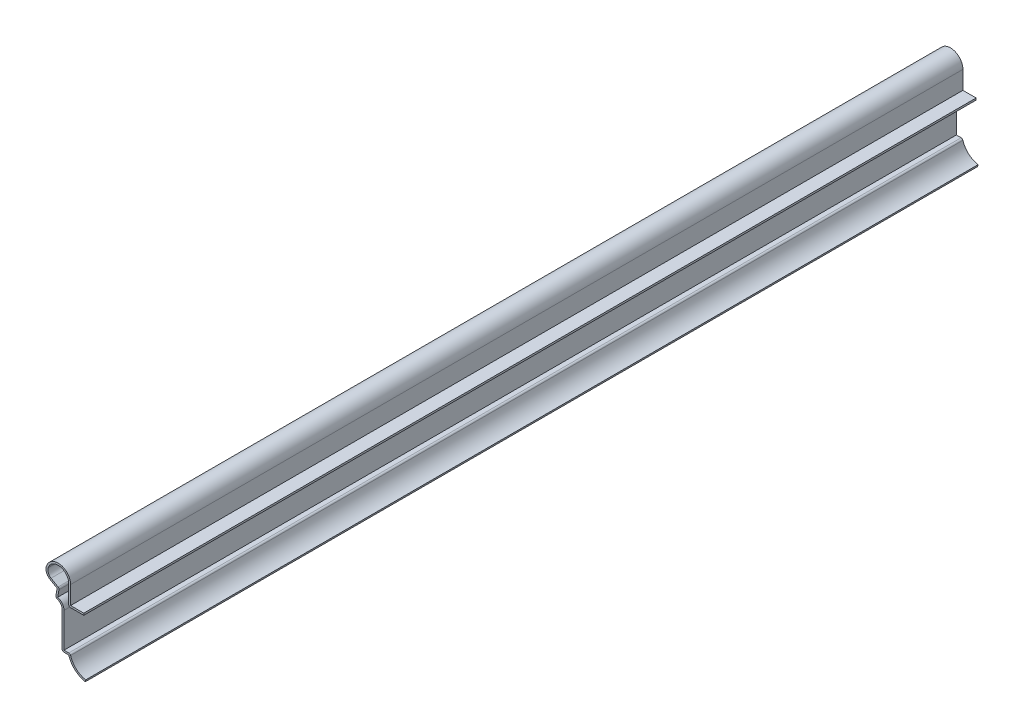
ISO-10303-21;
HEADER;
FILE_DESCRIPTION(('STEP AP214'),'2;1');
FILE_NAME('part.step','',(''),(''),'','','');
FILE_SCHEMA(('AUTOMOTIVE_DESIGN { 1 0 10303 214 1 1 1 1 }'));
ENDSEC;
DATA;
#1=APPLICATION_CONTEXT('core data for automotive mechanical design processes');
#2=APPLICATION_PROTOCOL_DEFINITION('international standard','automotive_design',2000,#1);
#3=PRODUCT_CONTEXT('',#1,'mechanical');
#4=PRODUCT('Part','Part','',(#3));
#5=PRODUCT_RELATED_PRODUCT_CATEGORY('part','',(#4));
#6=PRODUCT_DEFINITION_FORMATION('','',#4);
#7=PRODUCT_DEFINITION_CONTEXT('part definition',#1,'design');
#8=PRODUCT_DEFINITION('design','',#6,#7);
#9=PRODUCT_DEFINITION_SHAPE('','',#8);
#10=(LENGTH_UNIT() NAMED_UNIT(*) SI_UNIT(.MILLI.,.METRE.));
#11=(NAMED_UNIT(*) PLANE_ANGLE_UNIT() SI_UNIT($,.RADIAN.));
#12=(NAMED_UNIT(*) SI_UNIT($,.STERADIAN.) SOLID_ANGLE_UNIT());
#13=UNCERTAINTY_MEASURE_WITH_UNIT(LENGTH_MEASURE(1.E-05),#10,'distance_accuracy_value','');
#14=(GEOMETRIC_REPRESENTATION_CONTEXT(3) GLOBAL_UNCERTAINTY_ASSIGNED_CONTEXT((#13)) GLOBAL_UNIT_ASSIGNED_CONTEXT((#10,
#11,#12)) REPRESENTATION_CONTEXT('',''));
#15=CARTESIAN_POINT('',(0.,0.,0.));
#16=DIRECTION('',(0.,0.,1.));
#17=DIRECTION('',(1.,0.,0.));
#18=AXIS2_PLACEMENT_3D('',#15,#16,#17);
#19=CARTESIAN_POINT('',(-5.62173016512222,28.178125,-428.625));
#20=DIRECTION('',(0.,1.,0.));
#21=DIRECTION('',(0.,0.,1.));
#22=AXIS2_PLACEMENT_3D('',#19,#20,#21);
#23=PLANE('',#22);
#24=DIRECTION('',(1.,0.,0.));
#25=VECTOR('',#24,1.);
#26=CARTESIAN_POINT('',(-5.62173016512222,28.178125,0.));
#27=LINE('',#26,#25);
#28=CARTESIAN_POINT('',(-5.62173016512222,28.178125,0.));
#29=VERTEX_POINT('',#28);
#30=CARTESIAN_POINT('',(0.728269834877779,28.178125,0.));
#31=VERTEX_POINT('',#30);
#32=EDGE_CURVE('E234',#29,#31,#27,.T.);
#33=ORIENTED_EDGE('',*,*,#32,.T.);
#34=DIRECTION('',(0.,0.,1.));
#35=VECTOR('',#34,1.);
#36=CARTESIAN_POINT('',(0.728269834877779,28.178125,-428.625));
#37=LINE('',#36,#35);
#38=CARTESIAN_POINT('',(0.728269834877779,28.178125,-428.625));
#39=VERTEX_POINT('',#38);
#40=EDGE_CURVE('E216',#39,#31,#37,.T.);
#41=ORIENTED_EDGE('',*,*,#40,.F.);
#42=DIRECTION('',(1.,0.,0.));
#43=VECTOR('',#42,1.);
#44=CARTESIAN_POINT('',(-5.62173016512222,28.178125,-428.625));
#45=LINE('',#44,#43);
#46=CARTESIAN_POINT('',(-5.62173016512222,28.178125,-428.625));
#47=VERTEX_POINT('',#46);
#48=EDGE_CURVE('E222',#47,#39,#45,.T.);
#49=ORIENTED_EDGE('',*,*,#48,.F.);
#50=DIRECTION('',(0.,0.,1.));
#51=VECTOR('',#50,1.);
#52=CARTESIAN_POINT('',(-5.62173016512222,28.178125,-428.625));
#53=LINE('',#52,#51);
#54=EDGE_CURVE('E246',#47,#29,#53,.T.);
#55=ORIENTED_EDGE('',*,*,#54,.T.);
#56=EDGE_LOOP('',(#33,#41,#49,#55));
#57=FACE_BOUND('',#56,.T.);
#58=ADVANCED_FACE('F35',(#57),#23,.T.);
#59=CARTESIAN_POINT('',(-5.62173016512222,36.909375,-428.625));
#60=DIRECTION('',(1.,0.,0.));
#61=DIRECTION('',(0.,-1.,0.));
#62=AXIS2_PLACEMENT_3D('',#59,#60,#61);
#63=PLANE('',#62);
#64=DIRECTION('',(0.,-1.,0.));
#65=VECTOR('',#64,1.);
#66=CARTESIAN_POINT('',(-5.62173016512222,36.909375,0.));
#67=LINE('',#66,#65);
#68=CARTESIAN_POINT('',(-5.62173016512221,36.909375,0.));
#69=VERTEX_POINT('',#68);
#70=EDGE_CURVE('E231',#69,#29,#67,.T.);
#71=ORIENTED_EDGE('',*,*,#70,.T.);
#72=ORIENTED_EDGE('',*,*,#54,.F.);
#73=DIRECTION('',(0.,-1.,0.));
#74=VECTOR('',#73,1.);
#75=CARTESIAN_POINT('',(-5.62173016512222,36.909375,-428.625));
#76=LINE('',#75,#74);
#77=CARTESIAN_POINT('',(-5.62173016512221,36.909375,-428.625));
#78=VERTEX_POINT('',#77);
#79=EDGE_CURVE('E227',#78,#47,#76,.T.);
#80=ORIENTED_EDGE('',*,*,#79,.F.);
#81=DIRECTION('',(0.,0.,1.));
#82=VECTOR('',#81,1.);
#83=CARTESIAN_POINT('',(-5.62173016512221,36.909375,-428.625));
#84=LINE('',#83,#82);
#85=EDGE_CURVE('E347',#78,#69,#84,.T.);
#86=ORIENTED_EDGE('',*,*,#85,.T.);
#87=EDGE_LOOP('',(#71,#72,#80,#86));
#88=FACE_BOUND('',#87,.T.);
#89=ADVANCED_FACE('F453',(#88),#63,.T.);
#90=CARTESIAN_POINT('',(-11.5748551651222,36.909375,-428.625));
#91=DIRECTION('',(0.,0.,1.));
#92=DIRECTION('',(-1.,0.,0.));
#93=AXIS2_PLACEMENT_3D('',#90,#91,#92);
#94=CYLINDRICAL_SURFACE('',#93,5.953125);
#95=CARTESIAN_POINT('',(-11.5748551651222,36.909375,0.));
#96=DIRECTION('',(0.,0.,-1.));
#97=DIRECTION('',(-1.,0.,0.));
#98=AXIS2_PLACEMENT_3D('',#95,#96,#97);
#99=CIRCLE('',#98,5.953125);
#100=CARTESIAN_POINT('',(-17.2234836212635,38.7889211766331,0.));
#101=VERTEX_POINT('',#100);
#102=EDGE_CURVE('E343',#101,#69,#99,.T.);
#103=ORIENTED_EDGE('',*,*,#102,.T.);
#104=ORIENTED_EDGE('',*,*,#85,.F.);
#105=CARTESIAN_POINT('',(-11.5748551651222,36.909375,-428.625));
#106=DIRECTION('',(0.,0.,-1.));
#107=DIRECTION('',(-1.,0.,0.));
#108=AXIS2_PLACEMENT_3D('',#105,#106,#107);
#109=CIRCLE('',#108,5.953125);
#110=CARTESIAN_POINT('',(-17.2234836212635,38.7889211766331,-428.625));
#111=VERTEX_POINT('',#110);
#112=EDGE_CURVE('E238',#111,#78,#109,.T.);
#113=ORIENTED_EDGE('',*,*,#112,.F.);
#114=DIRECTION('',(0.,0.,1.));
#115=VECTOR('',#114,1.);
#116=CARTESIAN_POINT('',(-17.2234836212635,38.7889211766331,-428.625));
#117=LINE('',#116,#115);
#118=EDGE_CURVE('E350',#111,#101,#117,.T.);
#119=ORIENTED_EDGE('',*,*,#118,.T.);
#120=EDGE_LOOP('',(#103,#104,#113,#119));
#121=FACE_BOUND('',#120,.T.);
#122=ADVANCED_FACE('F449',(#121),#94,.T.);
#123=CARTESIAN_POINT('',(-13.4577313171693,37.535890392211,-428.625));
#124=DIRECTION('',(0.,0.,1.));
#125=DIRECTION('',(-1.,0.,0.));
#126=AXIS2_PLACEMENT_3D('',#123,#124,#125);
#127=CYLINDRICAL_SURFACE('',#126,3.96875);
#128=CARTESIAN_POINT('',(-13.4577313171693,37.535890392211,0.));
#129=DIRECTION('',(0.,0.,-1.));
#130=DIRECTION('',(-1.,0.,0.));
#131=AXIS2_PLACEMENT_3D('',#128,#129,#130);
#132=CIRCLE('',#131,3.96875);
#133=CARTESIAN_POINT('',(-15.4421063171693,34.0988520709416,0.));
#134=VERTEX_POINT('',#133);
#135=EDGE_CURVE('E341',#134,#101,#132,.T.);
#136=ORIENTED_EDGE('',*,*,#135,.T.);
#137=ORIENTED_EDGE('',*,*,#118,.F.);
#138=CARTESIAN_POINT('',(-13.4577313171693,37.535890392211,-428.625));
#139=DIRECTION('',(0.,0.,-1.));
#140=DIRECTION('',(-1.,0.,0.));
#141=AXIS2_PLACEMENT_3D('',#138,#139,#140);
#142=CIRCLE('',#141,3.96875);
#143=CARTESIAN_POINT('',(-15.4421063171693,34.0988520709416,-428.625));
#144=VERTEX_POINT('',#143);
#145=EDGE_CURVE('E442',#144,#111,#142,.T.);
#146=ORIENTED_EDGE('',*,*,#145,.F.);
#147=DIRECTION('',(0.,0.,1.));
#148=VECTOR('',#147,1.);
#149=CARTESIAN_POINT('',(-15.4421063171693,34.0988520709416,-428.625));
#150=LINE('',#149,#148);
#151=EDGE_CURVE('E353',#144,#134,#150,.T.);
#152=ORIENTED_EDGE('',*,*,#151,.T.);
#153=EDGE_LOOP('',(#136,#137,#146,#152));
#154=FACE_BOUND('',#153,.T.);
#155=ADVANCED_FACE('F458',(#154),#127,.T.);
#156=CARTESIAN_POINT('',(-12.061182855089,32.146875,-428.625));
#157=DIRECTION('',(-0.500000000000003,-0.866025403784437,0.));
#158=DIRECTION('',(-0.866025403784437,0.500000000000003,0.));
#159=AXIS2_PLACEMENT_3D('',#156,#157,#158);
#160=PLANE('',#159);
#161=DIRECTION('',(-0.866025403784437,0.500000000000003,0.));
#162=VECTOR('',#161,1.);
#163=CARTESIAN_POINT('',(-12.061182855089,32.146875,0.));
#164=LINE('',#163,#162);
#165=CARTESIAN_POINT('',(-12.061182855089,32.146875,0.));
#166=VERTEX_POINT('',#165);
#167=EDGE_CURVE('E339',#166,#134,#164,.T.);
#168=ORIENTED_EDGE('',*,*,#167,.T.);
#169=ORIENTED_EDGE('',*,*,#151,.F.);
#170=DIRECTION('',(-0.866025403784437,0.500000000000003,0.));
#171=VECTOR('',#170,1.);
#172=CARTESIAN_POINT('',(-12.061182855089,32.146875,-428.625));
#173=LINE('',#172,#171);
#174=CARTESIAN_POINT('',(-12.061182855089,32.146875,-428.625));
#175=VERTEX_POINT('',#174);
#176=EDGE_CURVE('E440',#175,#144,#173,.T.);
#177=ORIENTED_EDGE('',*,*,#176,.F.);
#178=DIRECTION('',(0.,0.,1.));
#179=VECTOR('',#178,1.);
#180=CARTESIAN_POINT('',(-12.061182855089,32.146875,-428.625));
#181=LINE('',#180,#179);
#182=EDGE_CURVE('E356',#175,#166,#181,.T.);
#183=ORIENTED_EDGE('',*,*,#182,.T.);
#184=EDGE_LOOP('',(#168,#169,#177,#183));
#185=FACE_BOUND('',#184,.T.);
#186=ADVANCED_FACE('F462',(#185),#160,.T.);
#187=CARTESIAN_POINT('',(-12.8309603302444,27.78125,-428.625));
#188=DIRECTION('',(-0.984807753012208,0.173648177666931,0.));
#189=DIRECTION('',(0.173648177666931,0.984807753012208,0.));
#190=AXIS2_PLACEMENT_3D('',#187,#188,#189);
#191=PLANE('',#190);
#192=DIRECTION('',(0.173648177666931,0.984807753012208,0.));
#193=VECTOR('',#192,1.);
#194=CARTESIAN_POINT('',(-12.8309603302444,27.78125,0.));
#195=LINE('',#194,#193);
#196=CARTESIAN_POINT('',(-12.6706512571569,28.6904079317213,0.));
#197=VERTEX_POINT('',#196);
#198=EDGE_CURVE('E337',#197,#166,#195,.T.);
#199=ORIENTED_EDGE('',*,*,#198,.T.);
#200=ORIENTED_EDGE('',*,*,#182,.F.);
#201=DIRECTION('',(0.173648177666931,0.984807753012208,0.));
#202=VECTOR('',#201,1.);
#203=CARTESIAN_POINT('',(-12.8309603302444,27.78125,-428.625));
#204=LINE('',#203,#202);
#205=CARTESIAN_POINT('',(-12.6706512571569,28.6904079317213,-428.625));
#206=VERTEX_POINT('',#205);
#207=EDGE_CURVE('E438',#206,#175,#204,.T.);
#208=ORIENTED_EDGE('',*,*,#207,.F.);
#209=DIRECTION('',(0.,0.,1.));
#210=VECTOR('',#209,1.);
#211=CARTESIAN_POINT('',(-12.6706512571569,28.6904079317213,-428.625));
#212=LINE('',#211,#210);
#213=EDGE_CURVE('E283',#197,#206,#212,.F.);
#214=ORIENTED_EDGE('',*,*,#213,.F.);
#215=EDGE_LOOP('',(#199,#200,#208,#214));
#216=FACE_BOUND('',#215,.T.);
#217=ADVANCED_FACE('F466',(#216),#191,.T.);
#218=CARTESIAN_POINT('',(-12.8309603302444,24.60625,-428.625));
#219=DIRECTION('',(0.,0.,1.));
#220=DIRECTION('',(-1.,0.,0.));
#221=AXIS2_PLACEMENT_3D('',#218,#219,#220);
#222=CYLINDRICAL_SURFACE('',#221,3.175);
#223=CARTESIAN_POINT('',(-12.8309603302444,24.60625,-428.625));
#224=DIRECTION('',(0.,0.,1.));
#225=DIRECTION('',(1.,0.,0.));
#226=AXIS2_PLACEMENT_3D('',#223,#224,#225);
#227=CIRCLE('',#226,3.175);
#228=CARTESIAN_POINT('',(-9.65596033024444,24.60625,-428.625));
#229=VERTEX_POINT('',#228);
#230=CARTESIAN_POINT('',(-12.0217391071855,27.6763942982621,-428.625));
#231=VERTEX_POINT('',#230);
#232=EDGE_CURVE('E435',#229,#231,#227,.T.);
#233=ORIENTED_EDGE('',*,*,#232,.F.);
#234=DIRECTION('',(0.,0.,1.));
#235=VECTOR('',#234,1.);
#236=CARTESIAN_POINT('',(-9.65596033024444,24.60625,-428.625));
#237=LINE('',#236,#235);
#238=CARTESIAN_POINT('',(-9.65596033024444,24.60625,0.));
#239=VERTEX_POINT('',#238);
#240=EDGE_CURVE('E359',#229,#239,#237,.T.);
#241=ORIENTED_EDGE('',*,*,#240,.T.);
#242=CARTESIAN_POINT('',(-12.8309603302444,24.60625,0.));
#243=DIRECTION('',(0.,0.,1.));
#244=DIRECTION('',(1.,0.,0.));
#245=AXIS2_PLACEMENT_3D('',#242,#243,#244);
#246=CIRCLE('',#245,3.175);
#247=CARTESIAN_POINT('',(-12.0217391071855,27.6763942982621,0.));
#248=VERTEX_POINT('',#247);
#249=EDGE_CURVE('E334',#239,#248,#246,.T.);
#250=ORIENTED_EDGE('',*,*,#249,.T.);
#251=DIRECTION('',(0.,0.,1.));
#252=VECTOR('',#251,1.);
#253=CARTESIAN_POINT('',(-12.0217391071855,27.6763942982621,-428.625));
#254=LINE('',#253,#252);
#255=EDGE_CURVE('E280',#231,#248,#254,.T.);
#256=ORIENTED_EDGE('',*,*,#255,.F.);
#257=EDGE_LOOP('',(#233,#241,#250,#256));
#258=FACE_BOUND('',#257,.T.);
#259=ADVANCED_FACE('F475',(#258),#222,.F.);
#260=CARTESIAN_POINT('',(-9.65596033024444,7.14375,-428.625));
#261=DIRECTION('',(-1.,0.,0.));
#262=DIRECTION('',(0.,1.,0.));
#263=AXIS2_PLACEMENT_3D('',#260,#261,#262);
#264=PLANE('',#263);
#265=DIRECTION('',(0.,1.,0.));
#266=VECTOR('',#265,1.);
#267=CARTESIAN_POINT('',(-9.65596033024444,7.14375,0.));
#268=LINE('',#267,#266);
#269=CARTESIAN_POINT('',(-9.65596033024444,8.03275,0.));
#270=VERTEX_POINT('',#269);
#271=EDGE_CURVE('E332',#270,#239,#268,.T.);
#272=ORIENTED_EDGE('',*,*,#271,.T.);
#273=ORIENTED_EDGE('',*,*,#240,.F.);
#274=DIRECTION('',(0.,1.,0.));
#275=VECTOR('',#274,1.);
#276=CARTESIAN_POINT('',(-9.65596033024444,7.14375,-428.625));
#277=LINE('',#276,#275);
#278=CARTESIAN_POINT('',(-9.65596033024444,8.03275,-428.625));
#279=VERTEX_POINT('',#278);
#280=EDGE_CURVE('E433',#279,#229,#277,.T.);
#281=ORIENTED_EDGE('',*,*,#280,.F.);
#282=DIRECTION('',(0.,0.,1.));
#283=VECTOR('',#282,1.);
#284=CARTESIAN_POINT('',(-9.65596033024444,8.03275,-428.625));
#285=LINE('',#284,#283);
#286=EDGE_CURVE('E271',#270,#279,#285,.F.);
#287=ORIENTED_EDGE('',*,*,#286,.F.);
#288=EDGE_LOOP('',(#272,#273,#281,#287));
#289=FACE_BOUND('',#288,.T.);
#290=ADVANCED_FACE('F479',(#289),#264,.T.);
#291=CARTESIAN_POINT('',(-6.48096033024444,7.14375,-428.625));
#292=DIRECTION('',(0.,-1.,0.));
#293=DIRECTION('',(0.,0.,-1.));
#294=AXIS2_PLACEMENT_3D('',#291,#292,#293);
#295=PLANE('',#294);
#296=DIRECTION('',(-1.,0.,0.));
#297=VECTOR('',#296,1.);
#298=CARTESIAN_POINT('',(-6.48096033024444,7.14375,-428.625));
#299=LINE('',#298,#297);
#300=CARTESIAN_POINT('',(-6.48096033024444,7.14375,-428.625));
#301=VERTEX_POINT('',#300);
#302=CARTESIAN_POINT('',(-8.76696033024444,7.14375,-428.625));
#303=VERTEX_POINT('',#302);
#304=EDGE_CURVE('E430',#301,#303,#299,.T.);
#305=ORIENTED_EDGE('',*,*,#304,.F.);
#306=DIRECTION('',(0.,0.,1.));
#307=VECTOR('',#306,1.);
#308=CARTESIAN_POINT('',(-6.48096033024444,7.14375,-428.625));
#309=LINE('',#308,#307);
#310=CARTESIAN_POINT('',(-6.48096033024444,7.14375,0.));
#311=VERTEX_POINT('',#310);
#312=EDGE_CURVE('E362',#301,#311,#309,.T.);
#313=ORIENTED_EDGE('',*,*,#312,.T.);
#314=DIRECTION('',(-1.,0.,0.));
#315=VECTOR('',#314,1.);
#316=CARTESIAN_POINT('',(-6.48096033024444,7.14375,0.));
#317=LINE('',#316,#315);
#318=CARTESIAN_POINT('',(-8.76696033024444,7.14375,0.));
#319=VERTEX_POINT('',#318);
#320=EDGE_CURVE('E329',#311,#319,#317,.T.);
#321=ORIENTED_EDGE('',*,*,#320,.T.);
#322=DIRECTION('',(0.,0.,1.));
#323=VECTOR('',#322,1.);
#324=CARTESIAN_POINT('',(-8.76696033024444,7.14375,-428.625));
#325=LINE('',#324,#323);
#326=EDGE_CURVE('E268',#303,#319,#325,.T.);
#327=ORIENTED_EDGE('',*,*,#326,.F.);
#328=EDGE_LOOP('',(#305,#313,#321,#327));
#329=FACE_BOUND('',#328,.T.);
#330=ADVANCED_FACE('F488',(#329),#295,.T.);
#331=CARTESIAN_POINT('',(3.3946889286634,10.1350963987865,-428.625));
#332=DIRECTION('',(0.,0.,1.));
#333=DIRECTION('',(-1.,0.,0.));
#334=AXIS2_PLACEMENT_3D('',#331,#332,#333);
#335=CYLINDRICAL_SURFACE('',#334,10.31875);
#336=CARTESIAN_POINT('',(3.3946889286634,10.1350963987865,0.));
#337=DIRECTION('',(0.,0.,-1.));
#338=DIRECTION('',(-1.,0.,0.));
#339=AXIS2_PLACEMENT_3D('',#336,#337,#338);
#340=CIRCLE('',#339,10.31875);
#341=CARTESIAN_POINT('',(1.45653966975556,0.,0.));
#342=VERTEX_POINT('',#341);
#343=EDGE_CURVE('E327',#342,#311,#340,.T.);
#344=ORIENTED_EDGE('',*,*,#343,.T.);
#345=ORIENTED_EDGE('',*,*,#312,.F.);
#346=CARTESIAN_POINT('',(3.3946889286634,10.1350963987865,-428.625));
#347=DIRECTION('',(0.,0.,-1.));
#348=DIRECTION('',(-1.,0.,0.));
#349=AXIS2_PLACEMENT_3D('',#346,#347,#348);
#350=CIRCLE('',#349,10.31875);
#351=CARTESIAN_POINT('',(1.45653966975556,0.,-428.625));
#352=VERTEX_POINT('',#351);
#353=EDGE_CURVE('E428',#352,#301,#350,.T.);
#354=ORIENTED_EDGE('',*,*,#353,.F.);
#355=DIRECTION('',(0.,0.,1.));
#356=VECTOR('',#355,1.);
#357=CARTESIAN_POINT('',(1.45653966975556,0.,-428.625));
#358=LINE('',#357,#356);
#359=EDGE_CURVE('E365',#352,#342,#358,.T.);
#360=ORIENTED_EDGE('',*,*,#359,.T.);
#361=EDGE_LOOP('',(#344,#345,#354,#360));
#362=FACE_BOUND('',#361,.T.);
#363=ADVANCED_FACE('F492',(#362),#335,.T.);
#364=CARTESIAN_POINT('',(1.45653966975556,0.,-428.625));
#365=DIRECTION('',(-0.982201952638304,0.187827911220627,0.));
#366=DIRECTION('',(0.187827911220627,0.982201952638303,0.));
#367=AXIS2_PLACEMENT_3D('',#364,#365,#366);
#368=PLANE('',#367);
#369=DIRECTION('',(0.187827911220627,0.982201952638303,0.));
#370=VECTOR('',#369,1.);
#371=CARTESIAN_POINT('',(1.45653966975556,0.,0.));
#372=LINE('',#371,#370);
#373=CARTESIAN_POINT('',(1.62351868283069,0.873177535895454,0.));
#374=VERTEX_POINT('',#373);
#375=EDGE_CURVE('E324',#342,#374,#372,.T.);
#376=ORIENTED_EDGE('',*,*,#375,.F.);
#377=ORIENTED_EDGE('',*,*,#359,.F.);
#378=DIRECTION('',(0.187827911220627,0.982201952638303,0.));
#379=VECTOR('',#378,1.);
#380=CARTESIAN_POINT('',(1.45653966975556,0.,-428.625));
#381=LINE('',#380,#379);
#382=CARTESIAN_POINT('',(1.62351868283069,0.873177535895454,-428.625));
#383=VERTEX_POINT('',#382);
#384=EDGE_CURVE('E425',#352,#383,#381,.T.);
#385=ORIENTED_EDGE('',*,*,#384,.T.);
#386=DIRECTION('',(0.,0.,1.));
#387=VECTOR('',#386,1.);
#388=CARTESIAN_POINT('',(1.62351868283069,0.873177535895454,-428.625));
#389=LINE('',#388,#387);
#390=EDGE_CURVE('E368',#383,#374,#389,.T.);
#391=ORIENTED_EDGE('',*,*,#390,.T.);
#392=EDGE_LOOP('',(#376,#377,#385,#391));
#393=FACE_BOUND('',#392,.T.);
#394=ADVANCED_FACE('F495',(#393),#368,.F.);
#395=CARTESIAN_POINT('',(3.3946889286634,10.1350963987865,-428.625));
#396=DIRECTION('',(0.,0.,1.));
#397=DIRECTION('',(-1.,0.,0.));
#398=AXIS2_PLACEMENT_3D('',#395,#396,#397);
#399=CYLINDRICAL_SURFACE('',#398,9.42975);
#400=CARTESIAN_POINT('',(3.3946889286634,10.1350963987865,0.));
#401=DIRECTION('',(0.,0.,-1.));
#402=DIRECTION('',(-1.,0.,0.));
#403=AXIS2_PLACEMENT_3D('',#400,#401,#402);
#404=CIRCLE('',#403,9.42975);
#405=CARTESIAN_POINT('',(-5.63013516332315,7.40146599743391,0.));
#406=VERTEX_POINT('',#405);
#407=EDGE_CURVE('E321',#374,#406,#404,.T.);
#408=ORIENTED_EDGE('',*,*,#407,.F.);
#409=ORIENTED_EDGE('',*,*,#390,.F.);
#410=CARTESIAN_POINT('',(3.3946889286634,10.1350963987865,-428.625));
#411=DIRECTION('',(0.,0.,-1.));
#412=DIRECTION('',(-1.,0.,0.));
#413=AXIS2_PLACEMENT_3D('',#410,#411,#412);
#414=CIRCLE('',#413,9.42975);
#415=CARTESIAN_POINT('',(-5.63013516332315,7.40146599743391,-428.625));
#416=VERTEX_POINT('',#415);
#417=EDGE_CURVE('E422',#383,#416,#414,.T.);
#418=ORIENTED_EDGE('',*,*,#417,.T.);
#419=DIRECTION('',(0.,0.,1.));
#420=VECTOR('',#419,1.);
#421=CARTESIAN_POINT('',(-5.63013516332315,7.40146599743391,-428.625));
#422=LINE('',#421,#420);
#423=EDGE_CURVE('E256',#406,#416,#422,.F.);
#424=ORIENTED_EDGE('',*,*,#423,.F.);
#425=EDGE_LOOP('',(#408,#409,#418,#424));
#426=FACE_BOUND('',#425,.T.);
#427=ADVANCED_FACE('F498',(#426),#399,.F.);
#428=CARTESIAN_POINT('',(-6.48096033024444,8.03275,-428.625));
#429=DIRECTION('',(0.,-1.,0.));
#430=DIRECTION('',(0.,0.,-1.));
#431=AXIS2_PLACEMENT_3D('',#428,#429,#430);
#432=PLANE('',#431);
#433=DIRECTION('',(-1.,0.,0.));
#434=VECTOR('',#433,1.);
#435=CARTESIAN_POINT('',(-6.48096033024444,8.03275,-428.625));
#436=LINE('',#435,#434);
#437=CARTESIAN_POINT('',(-6.48096033024444,8.03275,-428.625));
#438=VERTEX_POINT('',#437);
#439=CARTESIAN_POINT('',(-8.76696033024444,8.03275,-428.625));
#440=VERTEX_POINT('',#439);
#441=EDGE_CURVE('E419',#438,#440,#436,.T.);
#442=ORIENTED_EDGE('',*,*,#441,.T.);
#443=DIRECTION('',(0.,0.,1.));
#444=VECTOR('',#443,1.);
#445=CARTESIAN_POINT('',(-8.76696033024444,8.03275,-428.625));
#446=LINE('',#445,#444);
#447=CARTESIAN_POINT('',(-8.76696033024444,8.03275,0.));
#448=VERTEX_POINT('',#447);
#449=EDGE_CURVE('E371',#440,#448,#446,.T.);
#450=ORIENTED_EDGE('',*,*,#449,.T.);
#451=DIRECTION('',(-1.,0.,0.));
#452=VECTOR('',#451,1.);
#453=CARTESIAN_POINT('',(-6.48096033024444,8.03275,0.));
#454=LINE('',#453,#452);
#455=CARTESIAN_POINT('',(-6.48096033024444,8.03275,0.));
#456=VERTEX_POINT('',#455);
#457=EDGE_CURVE('E318',#456,#448,#454,.T.);
#458=ORIENTED_EDGE('',*,*,#457,.F.);
#459=DIRECTION('',(0.,0.,1.));
#460=VECTOR('',#459,1.);
#461=CARTESIAN_POINT('',(-6.48096033024444,8.03275,-428.625));
#462=LINE('',#461,#460);
#463=EDGE_CURVE('E242',#438,#456,#462,.T.);
#464=ORIENTED_EDGE('',*,*,#463,.F.);
#465=EDGE_LOOP('',(#442,#450,#458,#464));
#466=FACE_BOUND('',#465,.T.);
#467=ADVANCED_FACE('F506',(#466),#432,.F.);
#468=CARTESIAN_POINT('',(-8.76696033024444,7.14375,-428.625));
#469=DIRECTION('',(-1.,0.,0.));
#470=DIRECTION('',(0.,1.,0.));
#471=AXIS2_PLACEMENT_3D('',#468,#469,#470);
#472=PLANE('',#471);
#473=DIRECTION('',(0.,1.,0.));
#474=VECTOR('',#473,1.);
#475=CARTESIAN_POINT('',(-8.76696033024444,7.14375,0.));
#476=LINE('',#475,#474);
#477=CARTESIAN_POINT('',(-8.76696033024444,24.60625,0.));
#478=VERTEX_POINT('',#477);
#479=EDGE_CURVE('E315',#448,#478,#476,.T.);
#480=ORIENTED_EDGE('',*,*,#479,.F.);
#481=ORIENTED_EDGE('',*,*,#449,.F.);
#482=DIRECTION('',(0.,1.,0.));
#483=VECTOR('',#482,1.);
#484=CARTESIAN_POINT('',(-8.76696033024444,7.14375,-428.625));
#485=LINE('',#484,#483);
#486=CARTESIAN_POINT('',(-8.76696033024444,24.60625,-428.625));
#487=VERTEX_POINT('',#486);
#488=EDGE_CURVE('E416',#440,#487,#485,.T.);
#489=ORIENTED_EDGE('',*,*,#488,.T.);
#490=DIRECTION('',(0.,0.,1.));
#491=VECTOR('',#490,1.);
#492=CARTESIAN_POINT('',(-8.76696033024444,24.60625,-428.625));
#493=LINE('',#492,#491);
#494=EDGE_CURVE('E374',#487,#478,#493,.T.);
#495=ORIENTED_EDGE('',*,*,#494,.T.);
#496=EDGE_LOOP('',(#480,#481,#489,#495));
#497=FACE_BOUND('',#496,.T.);
#498=ADVANCED_FACE('F509',(#497),#472,.F.);
#499=CARTESIAN_POINT('',(-12.8309603302444,24.60625,-428.625));
#500=DIRECTION('',(0.,0.,1.));
#501=DIRECTION('',(-1.,0.,0.));
#502=AXIS2_PLACEMENT_3D('',#499,#500,#501);
#503=CYLINDRICAL_SURFACE('',#502,4.064);
#504=CARTESIAN_POINT('',(-12.8309603302444,24.60625,0.));
#505=DIRECTION('',(0.,0.,-1.));
#506=DIRECTION('',(-1.,0.,0.));
#507=AXIS2_PLACEMENT_3D('',#504,#505,#506);
#508=CIRCLE('',#507,4.064);
#509=CARTESIAN_POINT('',(-11.795157164729,28.5360347017754,0.));
#510=VERTEX_POINT('',#509);
#511=EDGE_CURVE('E312',#478,#510,#508,.F.);
#512=ORIENTED_EDGE('',*,*,#511,.F.);
#513=ORIENTED_EDGE('',*,*,#494,.F.);
#514=CARTESIAN_POINT('',(-12.8309603302444,24.60625,-428.625));
#515=DIRECTION('',(0.,0.,-1.));
#516=DIRECTION('',(-1.,0.,0.));
#517=AXIS2_PLACEMENT_3D('',#514,#515,#516);
#518=CIRCLE('',#517,4.064);
#519=CARTESIAN_POINT('',(-11.795157164729,28.5360347017754,-428.625));
#520=VERTEX_POINT('',#519);
#521=EDGE_CURVE('E413',#487,#520,#518,.F.);
#522=ORIENTED_EDGE('',*,*,#521,.T.);
#523=DIRECTION('',(0.,0.,1.));
#524=VECTOR('',#523,1.);
#525=CARTESIAN_POINT('',(-11.795157164729,28.5360347017754,-428.625));
#526=LINE('',#525,#524);
#527=EDGE_CURVE('E377',#520,#510,#526,.T.);
#528=ORIENTED_EDGE('',*,*,#527,.T.);
#529=EDGE_LOOP('',(#512,#513,#522,#528));
#530=FACE_BOUND('',#529,.T.);
#531=ADVANCED_FACE('F512',(#530),#503,.T.);
#532=CARTESIAN_POINT('',(-11.9554662378166,27.6268767700541,-428.625));
#533=DIRECTION('',(-0.984807753012208,0.173648177666931,0.));
#534=DIRECTION('',(0.173648177666931,0.984807753012208,0.));
#535=AXIS2_PLACEMENT_3D('',#532,#533,#534);
#536=PLANE('',#535);
#537=DIRECTION('',(0.173648177666931,0.984807753012208,0.));
#538=VECTOR('',#537,1.);
#539=CARTESIAN_POINT('',(-11.9554662378166,27.6268767700541,0.));
#540=LINE('',#539,#538);
#541=CARTESIAN_POINT('',(-11.1856887626612,31.9925017700541,0.));
#542=VERTEX_POINT('',#541);
#543=EDGE_CURVE('E309',#510,#542,#540,.T.);
#544=ORIENTED_EDGE('',*,*,#543,.F.);
#545=ORIENTED_EDGE('',*,*,#527,.F.);
#546=DIRECTION('',(0.173648177666931,0.984807753012208,0.));
#547=VECTOR('',#546,1.);
#548=CARTESIAN_POINT('',(-11.9554662378166,27.6268767700541,-428.625));
#549=LINE('',#548,#547);
#550=CARTESIAN_POINT('',(-11.1856887626612,31.9925017700541,-428.625));
#551=VERTEX_POINT('',#550);
#552=EDGE_CURVE('E405',#520,#551,#549,.T.);
#553=ORIENTED_EDGE('',*,*,#552,.T.);
#554=DIRECTION('',(0.,0.,1.));
#555=VECTOR('',#554,1.);
#556=CARTESIAN_POINT('',(-11.1856887626612,31.9925017700541,-428.625));
#557=LINE('',#556,#555);
#558=EDGE_CURVE('E277',#542,#551,#557,.F.);
#559=ORIENTED_EDGE('',*,*,#558,.F.);
#560=EDGE_LOOP('',(#544,#545,#553,#559));
#561=FACE_BOUND('',#560,.T.);
#562=ADVANCED_FACE('F516',(#561),#536,.F.);
#563=CARTESIAN_POINT('',(-11.616682855089,32.9167715839644,-428.625));
#564=DIRECTION('',(-0.500000000000003,-0.866025403784437,0.));
#565=DIRECTION('',(-0.866025403784437,0.500000000000003,0.));
#566=AXIS2_PLACEMENT_3D('',#563,#564,#565);
#567=PLANE('',#566);
#568=DIRECTION('',(-0.866025403784437,0.500000000000003,0.));
#569=VECTOR('',#568,1.);
#570=CARTESIAN_POINT('',(-11.616682855089,32.9167715839644,-428.625));
#571=LINE('',#570,#569);
#572=CARTESIAN_POINT('',(-11.616682855089,32.9167715839644,-428.625));
#573=VERTEX_POINT('',#572);
#574=CARTESIAN_POINT('',(-14.9976063171693,34.8687486549059,-428.625));
#575=VERTEX_POINT('',#574);
#576=EDGE_CURVE('E403',#573,#575,#571,.T.);
#577=ORIENTED_EDGE('',*,*,#576,.T.);
#578=DIRECTION('',(0.,0.,1.));
#579=VECTOR('',#578,1.);
#580=CARTESIAN_POINT('',(-14.9976063171693,34.8687486549059,-428.625));
#581=LINE('',#580,#579);
#582=CARTESIAN_POINT('',(-14.9976063171693,34.8687486549059,0.));
#583=VERTEX_POINT('',#582);
#584=EDGE_CURVE('E380',#575,#583,#581,.T.);
#585=ORIENTED_EDGE('',*,*,#584,.T.);
#586=DIRECTION('',(-0.866025403784437,0.500000000000003,0.));
#587=VECTOR('',#586,1.);
#588=CARTESIAN_POINT('',(-11.616682855089,32.9167715839644,0.));
#589=LINE('',#588,#587);
#590=CARTESIAN_POINT('',(-11.616682855089,32.9167715839644,0.));
#591=VERTEX_POINT('',#590);
#592=EDGE_CURVE('E306',#591,#583,#589,.T.);
#593=ORIENTED_EDGE('',*,*,#592,.F.);
#594=DIRECTION('',(0.,0.,1.));
#595=VECTOR('',#594,1.);
#596=CARTESIAN_POINT('',(-11.616682855089,32.9167715839644,-428.625));
#597=LINE('',#596,#595);
#598=EDGE_CURVE('E274',#573,#591,#597,.T.);
#599=ORIENTED_EDGE('',*,*,#598,.F.);
#600=EDGE_LOOP('',(#577,#585,#593,#599));
#601=FACE_BOUND('',#600,.T.);
#602=ADVANCED_FACE('F521',(#601),#567,.F.);
#603=CARTESIAN_POINT('',(-13.4577313171693,37.535890392211,-428.625));
#604=DIRECTION('',(0.,0.,1.));
#605=DIRECTION('',(-1.,0.,0.));
#606=AXIS2_PLACEMENT_3D('',#603,#604,#605);
#607=CYLINDRICAL_SURFACE('',#606,3.07975);
#608=CARTESIAN_POINT('',(-13.4577313171693,37.535890392211,0.));
#609=DIRECTION('',(0.,0.,-1.));
#610=DIRECTION('',(-1.,0.,0.));
#611=AXIS2_PLACEMENT_3D('',#608,#609,#610);
#612=CIRCLE('',#611,3.07975);
#613=CARTESIAN_POINT('',(-16.3799551051464,38.5082422809226,0.));
#614=VERTEX_POINT('',#613);
#615=EDGE_CURVE('E303',#583,#614,#612,.T.);
#616=ORIENTED_EDGE('',*,*,#615,.F.);
#617=ORIENTED_EDGE('',*,*,#584,.F.);
#618=CARTESIAN_POINT('',(-13.4577313171693,37.535890392211,-428.625));
#619=DIRECTION('',(0.,0.,-1.));
#620=DIRECTION('',(-1.,0.,0.));
#621=AXIS2_PLACEMENT_3D('',#618,#619,#620);
#622=CIRCLE('',#621,3.07975);
#623=CARTESIAN_POINT('',(-16.3799551051464,38.5082422809226,-428.625));
#624=VERTEX_POINT('',#623);
#625=EDGE_CURVE('E401',#575,#624,#622,.T.);
#626=ORIENTED_EDGE('',*,*,#625,.T.);
#627=DIRECTION('',(0.,0.,1.));
#628=VECTOR('',#627,1.);
#629=CARTESIAN_POINT('',(-16.3799551051464,38.5082422809226,-428.625));
#630=LINE('',#629,#628);
#631=EDGE_CURVE('E383',#624,#614,#630,.T.);
#632=ORIENTED_EDGE('',*,*,#631,.T.);
#633=EDGE_LOOP('',(#616,#617,#626,#632));
#634=FACE_BOUND('',#633,.T.);
#635=ADVANCED_FACE('F398',(#634),#607,.F.);
#636=CARTESIAN_POINT('',(-11.5748551651222,36.909375,-428.625));
#637=DIRECTION('',(0.,0.,1.));
#638=DIRECTION('',(-1.,0.,0.));
#639=AXIS2_PLACEMENT_3D('',#636,#637,#638);
#640=CYLINDRICAL_SURFACE('',#639,5.064125);
#641=CARTESIAN_POINT('',(-11.5748551651222,36.909375,0.));
#642=DIRECTION('',(0.,0.,-1.));
#643=DIRECTION('',(-1.,0.,0.));
#644=AXIS2_PLACEMENT_3D('',#641,#642,#643);
#645=CIRCLE('',#644,5.064125);
#646=CARTESIAN_POINT('',(-6.51073016512222,36.909375,0.));
#647=VERTEX_POINT('',#646);
#648=EDGE_CURVE('E296',#614,#647,#645,.T.);
#649=ORIENTED_EDGE('',*,*,#648,.F.);
#650=ORIENTED_EDGE('',*,*,#631,.F.);
#651=CARTESIAN_POINT('',(-11.5748551651222,36.909375,-428.625));
#652=DIRECTION('',(0.,0.,-1.));
#653=DIRECTION('',(-1.,0.,0.));
#654=AXIS2_PLACEMENT_3D('',#651,#652,#653);
#655=CIRCLE('',#654,5.064125);
#656=CARTESIAN_POINT('',(-6.51073016512222,36.909375,-428.625));
#657=VERTEX_POINT('',#656);
#658=EDGE_CURVE('E391',#624,#657,#655,.T.);
#659=ORIENTED_EDGE('',*,*,#658,.T.);
#660=DIRECTION('',(0.,0.,1.));
#661=VECTOR('',#660,1.);
#662=CARTESIAN_POINT('',(-6.51073016512222,36.909375,-428.625));
#663=LINE('',#662,#661);
#664=EDGE_CURVE('E236',#657,#647,#663,.T.);
#665=ORIENTED_EDGE('',*,*,#664,.T.);
#666=EDGE_LOOP('',(#649,#650,#659,#665));
#667=FACE_BOUND('',#666,.T.);
#668=ADVANCED_FACE('F389',(#667),#640,.F.);
#669=CARTESIAN_POINT('',(-6.51073016512222,36.909375,-428.625));
#670=DIRECTION('',(1.,0.,0.));
#671=DIRECTION('',(0.,-1.,0.));
#672=AXIS2_PLACEMENT_3D('',#669,#670,#671);
#673=PLANE('',#672);
#674=DIRECTION('',(0.,-1.,0.));
#675=VECTOR('',#674,1.);
#676=CARTESIAN_POINT('',(-6.51073016512222,36.909375,0.));
#677=LINE('',#676,#675);
#678=CARTESIAN_POINT('',(-6.51073016512222,28.178125,0.));
#679=VERTEX_POINT('',#678);
#680=EDGE_CURVE('E292',#647,#679,#677,.T.);
#681=ORIENTED_EDGE('',*,*,#680,.F.);
#682=ORIENTED_EDGE('',*,*,#664,.F.);
#683=DIRECTION('',(0.,-1.,0.));
#684=VECTOR('',#683,1.);
#685=CARTESIAN_POINT('',(-6.51073016512222,36.909375,-428.625));
#686=LINE('',#685,#684);
#687=CARTESIAN_POINT('',(-6.51073016512222,28.178125,-428.625));
#688=VERTEX_POINT('',#687);
#689=EDGE_CURVE('E407',#657,#688,#686,.T.);
#690=ORIENTED_EDGE('',*,*,#689,.T.);
#691=DIRECTION('',(0.,0.,1.));
#692=VECTOR('',#691,1.);
#693=CARTESIAN_POINT('',(-6.51073016512222,28.178125,-428.625));
#694=LINE('',#693,#692);
#695=EDGE_CURVE('E11',#679,#688,#694,.F.);
#696=ORIENTED_EDGE('',*,*,#695,.F.);
#697=EDGE_LOOP('',(#681,#682,#690,#696));
#698=FACE_BOUND('',#697,.T.);
#699=ADVANCED_FACE('F605',(#698),#673,.F.);
#700=CARTESIAN_POINT('',(-5.62173016512222,27.289125,-428.625));
#701=DIRECTION('',(0.,1.,0.));
#702=DIRECTION('',(0.,0.,1.));
#703=AXIS2_PLACEMENT_3D('',#700,#701,#702);
#704=PLANE('',#703);
#705=DIRECTION('',(-1.,0.,0.));
#706=VECTOR('',#705,1.);
#707=CARTESIAN_POINT('',(-5.62173016512222,27.289125,-428.625));
#708=LINE('',#707,#706);
#709=CARTESIAN_POINT('',(-5.62173016512222,27.289125,-428.625));
#710=VERTEX_POINT('',#709);
#711=CARTESIAN_POINT('',(0.728269834877779,27.289125,-428.625));
#712=VERTEX_POINT('',#711);
#713=EDGE_CURVE('E221',#710,#712,#708,.F.);
#714=ORIENTED_EDGE('',*,*,#713,.T.);
#715=DIRECTION('',(0.,0.,1.));
#716=VECTOR('',#715,1.);
#717=CARTESIAN_POINT('',(0.728269834877779,27.289125,-428.625));
#718=LINE('',#717,#716);
#719=CARTESIAN_POINT('',(0.728269834877779,27.289125,0.));
#720=VERTEX_POINT('',#719);
#721=EDGE_CURVE('E219',#712,#720,#718,.T.);
#722=ORIENTED_EDGE('',*,*,#721,.T.);
#723=DIRECTION('',(-1.,0.,0.));
#724=VECTOR('',#723,1.);
#725=CARTESIAN_POINT('',(-5.62173016512222,27.289125,0.));
#726=LINE('',#725,#724);
#727=CARTESIAN_POINT('',(-5.62173016512222,27.289125,0.));
#728=VERTEX_POINT('',#727);
#729=EDGE_CURVE('E289',#728,#720,#726,.F.);
#730=ORIENTED_EDGE('',*,*,#729,.F.);
#731=DIRECTION('',(0.,0.,1.));
#732=VECTOR('',#731,1.);
#733=CARTESIAN_POINT('',(-5.62173016512222,27.289125,-428.625));
#734=LINE('',#733,#732);
#735=EDGE_CURVE('E43',#710,#728,#734,.T.);
#736=ORIENTED_EDGE('',*,*,#735,.F.);
#737=EDGE_LOOP('',(#714,#722,#730,#736));
#738=FACE_BOUND('',#737,.T.);
#739=ADVANCED_FACE('F290',(#738),#704,.F.);
#740=CARTESIAN_POINT('',(0.728269834877779,27.289125,-428.625));
#741=DIRECTION('',(-1.,0.,0.));
#742=DIRECTION('',(0.,0.,-1.));
#743=AXIS2_PLACEMENT_3D('',#740,#741,#742);
#744=PLANE('',#743);
#745=DIRECTION('',(0.,1.,0.));
#746=VECTOR('',#745,1.);
#747=CARTESIAN_POINT('',(0.728269834877779,27.289125,0.));
#748=LINE('',#747,#746);
#749=EDGE_CURVE('E293',#720,#31,#748,.T.);
#750=ORIENTED_EDGE('',*,*,#749,.F.);
#751=ORIENTED_EDGE('',*,*,#721,.F.);
#752=DIRECTION('',(0.,1.,0.));
#753=VECTOR('',#752,1.);
#754=CARTESIAN_POINT('',(0.728269834877779,27.289125,-428.625));
#755=LINE('',#754,#753);
#756=EDGE_CURVE('E212',#712,#39,#755,.T.);
#757=ORIENTED_EDGE('',*,*,#756,.T.);
#758=ORIENTED_EDGE('',*,*,#40,.T.);
#759=EDGE_LOOP('',(#750,#751,#757,#758));
#760=FACE_BOUND('',#759,.T.);
#761=ADVANCED_FACE('F214',(#760),#744,.F.);
#762=CARTESIAN_POINT('',(-11.5748551651222,36.909375,-428.625));
#763=DIRECTION('',(0.,0.,1.));
#764=DIRECTION('',(-1.,0.,0.));
#765=AXIS2_PLACEMENT_3D('',#762,#763,#764);
#766=PLANE('',#765);
#767=ORIENTED_EDGE('',*,*,#417,.F.);
#768=ORIENTED_EDGE('',*,*,#384,.F.);
#769=ORIENTED_EDGE('',*,*,#353,.T.);
#770=ORIENTED_EDGE('',*,*,#304,.T.);
#771=CARTESIAN_POINT('',(-8.76696033024444,8.03275,-428.625));
#772=DIRECTION('',(0.,0.,-1.));
#773=DIRECTION('',(-1.,0.,0.));
#774=AXIS2_PLACEMENT_3D('',#771,#772,#773);
#775=CIRCLE('',#774,0.889);
#776=EDGE_CURVE('E264',#279,#303,#775,.F.);
#777=ORIENTED_EDGE('',*,*,#776,.F.);
#778=ORIENTED_EDGE('',*,*,#280,.T.);
#779=ORIENTED_EDGE('',*,*,#232,.T.);
#780=CARTESIAN_POINT('',(-11.795157164729,28.5360347017754,-428.625));
#781=DIRECTION('',(0.,0.,-1.));
#782=DIRECTION('',(-1.,0.,0.));
#783=AXIS2_PLACEMENT_3D('',#780,#781,#782);
#784=CIRCLE('',#783,0.889);
#785=EDGE_CURVE('E260',#206,#231,#784,.F.);
#786=ORIENTED_EDGE('',*,*,#785,.F.);
#787=ORIENTED_EDGE('',*,*,#207,.T.);
#788=ORIENTED_EDGE('',*,*,#176,.T.);
#789=ORIENTED_EDGE('',*,*,#145,.T.);
#790=ORIENTED_EDGE('',*,*,#112,.T.);
#791=ORIENTED_EDGE('',*,*,#79,.T.);
#792=ORIENTED_EDGE('',*,*,#48,.T.);
#793=ORIENTED_EDGE('',*,*,#756,.F.);
#794=ORIENTED_EDGE('',*,*,#713,.F.);
#795=CARTESIAN_POINT('',(-5.62173016512222,28.178125,-428.625));
#796=DIRECTION('',(0.,0.,-1.));
#797=DIRECTION('',(-1.,0.,0.));
#798=AXIS2_PLACEMENT_3D('',#795,#796,#797);
#799=CIRCLE('',#798,0.889);
#800=EDGE_CURVE('E49',#688,#710,#799,.F.);
#801=ORIENTED_EDGE('',*,*,#800,.F.);
#802=ORIENTED_EDGE('',*,*,#689,.F.);
#803=ORIENTED_EDGE('',*,*,#658,.F.);
#804=ORIENTED_EDGE('',*,*,#625,.F.);
#805=ORIENTED_EDGE('',*,*,#576,.F.);
#806=CARTESIAN_POINT('',(-12.061182855089,32.146875,-428.625));
#807=DIRECTION('',(0.,0.,-1.));
#808=DIRECTION('',(-1.,0.,0.));
#809=AXIS2_PLACEMENT_3D('',#806,#807,#808);
#810=CIRCLE('',#809,0.889);
#811=EDGE_CURVE('E262',#551,#573,#810,.F.);
#812=ORIENTED_EDGE('',*,*,#811,.F.);
#813=ORIENTED_EDGE('',*,*,#552,.F.);
#814=ORIENTED_EDGE('',*,*,#521,.F.);
#815=ORIENTED_EDGE('',*,*,#488,.F.);
#816=ORIENTED_EDGE('',*,*,#441,.F.);
#817=CARTESIAN_POINT('',(-6.48096033024444,7.14375,-428.625));
#818=DIRECTION('',(0.,0.,-1.));
#819=DIRECTION('',(-1.,0.,0.));
#820=AXIS2_PLACEMENT_3D('',#817,#818,#819);
#821=CIRCLE('',#820,0.889);
#822=EDGE_CURVE('E266',#416,#438,#821,.F.);
#823=ORIENTED_EDGE('',*,*,#822,.F.);
#824=EDGE_LOOP('',(#767,#768,#769,#770,#777,#778,#779,#786,#787,#788,#789,#790,#791,#792,#793,
#794,#801,#802,#803,#804,#805,#812,#813,#814,#815,#816,#823));
#825=FACE_BOUND('',#824,.T.);
#826=ADVANCED_FACE('F225',(#825),#766,.F.);
#827=CARTESIAN_POINT('',(-11.5748551651222,36.909375,0.));
#828=DIRECTION('',(0.,0.,1.));
#829=DIRECTION('',(-1.,0.,0.));
#830=AXIS2_PLACEMENT_3D('',#827,#828,#829);
#831=PLANE('',#830);
#832=ORIENTED_EDGE('',*,*,#457,.T.);
#833=ORIENTED_EDGE('',*,*,#479,.T.);
#834=ORIENTED_EDGE('',*,*,#511,.T.);
#835=ORIENTED_EDGE('',*,*,#543,.T.);
#836=CARTESIAN_POINT('',(-12.061182855089,32.146875,0.));
#837=DIRECTION('',(0.,0.,-1.));
#838=DIRECTION('',(-1.,0.,0.));
#839=AXIS2_PLACEMENT_3D('',#836,#837,#838);
#840=CIRCLE('',#839,0.889);
#841=EDGE_CURVE('E250',#591,#542,#840,.T.);
#842=ORIENTED_EDGE('',*,*,#841,.F.);
#843=ORIENTED_EDGE('',*,*,#592,.T.);
#844=ORIENTED_EDGE('',*,*,#615,.T.);
#845=ORIENTED_EDGE('',*,*,#648,.T.);
#846=ORIENTED_EDGE('',*,*,#680,.T.);
#847=CARTESIAN_POINT('',(-5.62173016512222,28.178125,0.));
#848=DIRECTION('',(0.,0.,-1.));
#849=DIRECTION('',(-1.,0.,0.));
#850=AXIS2_PLACEMENT_3D('',#847,#848,#849);
#851=CIRCLE('',#850,0.889);
#852=EDGE_CURVE('E245',#728,#679,#851,.T.);
#853=ORIENTED_EDGE('',*,*,#852,.F.);
#854=ORIENTED_EDGE('',*,*,#729,.T.);
#855=ORIENTED_EDGE('',*,*,#749,.T.);
#856=ORIENTED_EDGE('',*,*,#32,.F.);
#857=ORIENTED_EDGE('',*,*,#70,.F.);
#858=ORIENTED_EDGE('',*,*,#102,.F.);
#859=ORIENTED_EDGE('',*,*,#135,.F.);
#860=ORIENTED_EDGE('',*,*,#167,.F.);
#861=ORIENTED_EDGE('',*,*,#198,.F.);
#862=CARTESIAN_POINT('',(-11.795157164729,28.5360347017754,0.));
#863=DIRECTION('',(0.,0.,-1.));
#864=DIRECTION('',(-1.,0.,0.));
#865=AXIS2_PLACEMENT_3D('',#862,#863,#864);
#866=CIRCLE('',#865,0.889);
#867=EDGE_CURVE('E248',#248,#197,#866,.T.);
#868=ORIENTED_EDGE('',*,*,#867,.F.);
#869=ORIENTED_EDGE('',*,*,#249,.F.);
#870=ORIENTED_EDGE('',*,*,#271,.F.);
#871=CARTESIAN_POINT('',(-8.76696033024444,8.03275,0.));
#872=DIRECTION('',(0.,0.,-1.));
#873=DIRECTION('',(-1.,0.,0.));
#874=AXIS2_PLACEMENT_3D('',#871,#872,#873);
#875=CIRCLE('',#874,0.889);
#876=EDGE_CURVE('E252',#319,#270,#875,.T.);
#877=ORIENTED_EDGE('',*,*,#876,.F.);
#878=ORIENTED_EDGE('',*,*,#320,.F.);
#879=ORIENTED_EDGE('',*,*,#343,.F.);
#880=ORIENTED_EDGE('',*,*,#375,.T.);
#881=ORIENTED_EDGE('',*,*,#407,.T.);
#882=CARTESIAN_POINT('',(-6.48096033024444,7.14375,0.));
#883=DIRECTION('',(0.,0.,-1.));
#884=DIRECTION('',(-1.,0.,0.));
#885=AXIS2_PLACEMENT_3D('',#882,#883,#884);
#886=CIRCLE('',#885,0.889);
#887=EDGE_CURVE('E254',#456,#406,#886,.T.);
#888=ORIENTED_EDGE('',*,*,#887,.F.);
#889=EDGE_LOOP('',(#832,#833,#834,#835,#842,#843,#844,#845,#846,#853,#854,#855,#856,#857,#858,
#859,#860,#861,#868,#869,#870,#877,#878,#879,#880,#881,#888));
#890=FACE_BOUND('',#889,.T.);
#891=ADVANCED_FACE('F394',(#890),#831,.T.);
#892=CARTESIAN_POINT('',(-6.48096033024444,7.14375,-428.625));
#893=DIRECTION('',(0.,0.,1.));
#894=DIRECTION('',(-1.,0.,0.));
#895=AXIS2_PLACEMENT_3D('',#892,#893,#894);
#896=CYLINDRICAL_SURFACE('',#895,0.889);
#897=ORIENTED_EDGE('',*,*,#822,.T.);
#898=ORIENTED_EDGE('',*,*,#463,.T.);
#899=ORIENTED_EDGE('',*,*,#887,.T.);
#900=ORIENTED_EDGE('',*,*,#423,.T.);
#901=EDGE_LOOP('',(#897,#898,#899,#900));
#902=FACE_BOUND('',#901,.T.);
#903=ADVANCED_FACE('F501',(#902),#896,.T.);
#904=CARTESIAN_POINT('',(-8.76696033024444,8.03275,-428.625));
#905=DIRECTION('',(0.,0.,1.));
#906=DIRECTION('',(-1.,0.,0.));
#907=AXIS2_PLACEMENT_3D('',#904,#905,#906);
#908=CYLINDRICAL_SURFACE('',#907,0.889);
#909=ORIENTED_EDGE('',*,*,#776,.T.);
#910=ORIENTED_EDGE('',*,*,#326,.T.);
#911=ORIENTED_EDGE('',*,*,#876,.T.);
#912=ORIENTED_EDGE('',*,*,#286,.T.);
#913=EDGE_LOOP('',(#909,#910,#911,#912));
#914=FACE_BOUND('',#913,.T.);
#915=ADVANCED_FACE('F485',(#914),#908,.T.);
#916=CARTESIAN_POINT('',(-12.061182855089,32.146875,-428.625));
#917=DIRECTION('',(0.,0.,1.));
#918=DIRECTION('',(-1.,0.,0.));
#919=AXIS2_PLACEMENT_3D('',#916,#917,#918);
#920=CYLINDRICAL_SURFACE('',#919,0.889);
#921=ORIENTED_EDGE('',*,*,#811,.T.);
#922=ORIENTED_EDGE('',*,*,#598,.T.);
#923=ORIENTED_EDGE('',*,*,#841,.T.);
#924=ORIENTED_EDGE('',*,*,#558,.T.);
#925=EDGE_LOOP('',(#921,#922,#923,#924));
#926=FACE_BOUND('',#925,.T.);
#927=ADVANCED_FACE('F518',(#926),#920,.T.);
#928=CARTESIAN_POINT('',(-11.795157164729,28.5360347017754,-428.625));
#929=DIRECTION('',(0.,0.,1.));
#930=DIRECTION('',(-1.,0.,0.));
#931=AXIS2_PLACEMENT_3D('',#928,#929,#930);
#932=CYLINDRICAL_SURFACE('',#931,0.889);
#933=ORIENTED_EDGE('',*,*,#785,.T.);
#934=ORIENTED_EDGE('',*,*,#255,.T.);
#935=ORIENTED_EDGE('',*,*,#867,.T.);
#936=ORIENTED_EDGE('',*,*,#213,.T.);
#937=EDGE_LOOP('',(#933,#934,#935,#936));
#938=FACE_BOUND('',#937,.T.);
#939=ADVANCED_FACE('F472',(#938),#932,.T.);
#940=CARTESIAN_POINT('',(-5.62173016512222,28.178125,-428.625));
#941=DIRECTION('',(0.,0.,1.));
#942=DIRECTION('',(-1.,0.,0.));
#943=AXIS2_PLACEMENT_3D('',#940,#941,#942);
#944=CYLINDRICAL_SURFACE('',#943,0.889);
#945=ORIENTED_EDGE('',*,*,#800,.T.);
#946=ORIENTED_EDGE('',*,*,#735,.T.);
#947=ORIENTED_EDGE('',*,*,#852,.T.);
#948=ORIENTED_EDGE('',*,*,#695,.T.);
#949=EDGE_LOOP('',(#945,#946,#947,#948));
#950=FACE_BOUND('',#949,.T.);
#951=ADVANCED_FACE('F37',(#950),#944,.T.);
#952=CLOSED_SHELL('',(#58,#89,#122,#155,#186,#217,#259,#290,#330,#363,#394,#427,#467,#498,#531,
#562,#602,#635,#668,#699,#739,#761,#826,#891,#903,#915,#927,#939,#951));
#953=MANIFOLD_SOLID_BREP('B2',#952);
#954=ADVANCED_BREP_SHAPE_REPRESENTATION('',(#18,#953),#14);
#955=SHAPE_DEFINITION_REPRESENTATION(#9,#954);
ENDSEC;
END-ISO-10303-21;
